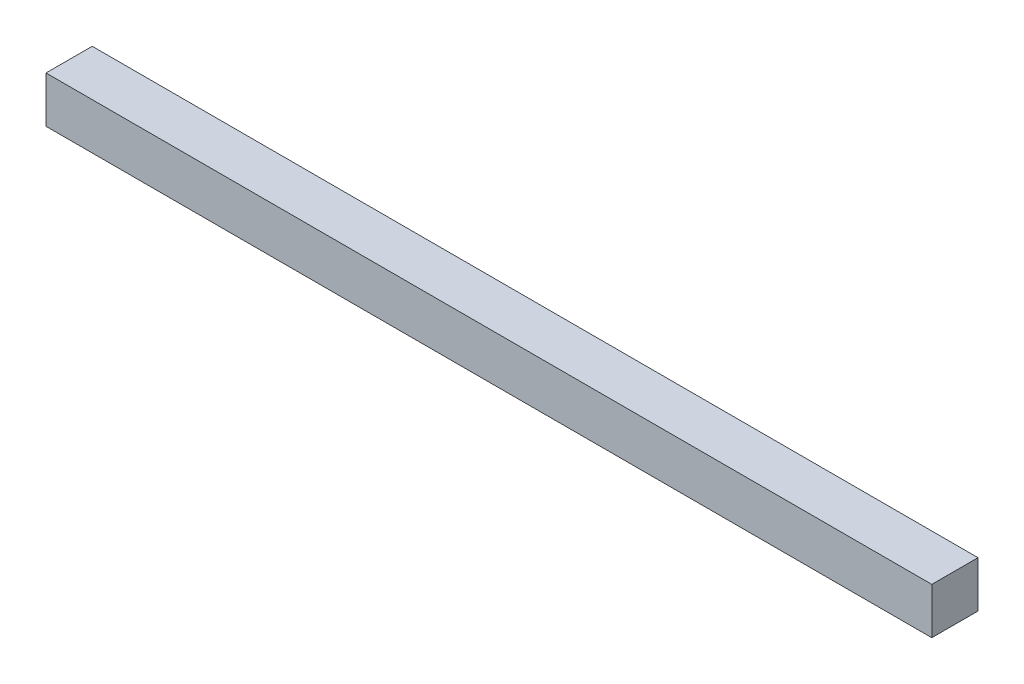
ISO-10303-21;
HEADER;
FILE_DESCRIPTION(('STEP AP214'),'2;1');
FILE_NAME('part.step','',(''),(''),'','','');
FILE_SCHEMA(('AUTOMOTIVE_DESIGN { 1 0 10303 214 1 1 1 1 }'));
ENDSEC;
DATA;
#1=APPLICATION_CONTEXT('core data for automotive mechanical design processes');
#2=APPLICATION_PROTOCOL_DEFINITION('international standard','automotive_design',2000,#1);
#3=PRODUCT_CONTEXT('',#1,'mechanical');
#4=PRODUCT('Part','Part','',(#3));
#5=PRODUCT_RELATED_PRODUCT_CATEGORY('part','',(#4));
#6=PRODUCT_DEFINITION_FORMATION('','',#4);
#7=PRODUCT_DEFINITION_CONTEXT('part definition',#1,'design');
#8=PRODUCT_DEFINITION('design','',#6,#7);
#9=PRODUCT_DEFINITION_SHAPE('','',#8);
#10=(LENGTH_UNIT() NAMED_UNIT(*) SI_UNIT(.MILLI.,.METRE.));
#11=(NAMED_UNIT(*) PLANE_ANGLE_UNIT() SI_UNIT($,.RADIAN.));
#12=(NAMED_UNIT(*) SI_UNIT($,.STERADIAN.) SOLID_ANGLE_UNIT());
#13=UNCERTAINTY_MEASURE_WITH_UNIT(LENGTH_MEASURE(1.E-05),#10,'distance_accuracy_value','');
#14=(GEOMETRIC_REPRESENTATION_CONTEXT(3) GLOBAL_UNCERTAINTY_ASSIGNED_CONTEXT((#13)) GLOBAL_UNIT_ASSIGNED_CONTEXT((#10,
#11,#12)) REPRESENTATION_CONTEXT('',''));
#15=CARTESIAN_POINT('',(0.,0.,0.));
#16=DIRECTION('',(0.,0.,1.));
#17=DIRECTION('',(1.,0.,0.));
#18=AXIS2_PLACEMENT_3D('',#15,#16,#17);
#19=CARTESIAN_POINT('',(5.75,0.3,0.3));
#20=DIRECTION('',(-1.,0.,0.));
#21=DIRECTION('',(0.,0.,1.));
#22=AXIS2_PLACEMENT_3D('',#19,#20,#21);
#23=PLANE('',#22);
#24=DIRECTION('',(0.,0.,-1.));
#25=VECTOR('',#24,1.);
#26=CARTESIAN_POINT('',(5.75,-0.3,0.3));
#27=LINE('',#26,#25);
#28=CARTESIAN_POINT('',(5.75,-0.3,0.3));
#29=VERTEX_POINT('',#28);
#30=CARTESIAN_POINT('',(5.75,-0.3,-0.3));
#31=VERTEX_POINT('',#30);
#32=EDGE_CURVE('E95',#29,#31,#27,.T.);
#33=ORIENTED_EDGE('',*,*,#32,.T.);
#34=DIRECTION('',(0.,-1.,0.));
#35=VECTOR('',#34,1.);
#36=CARTESIAN_POINT('',(5.75,0.3,-0.3));
#37=LINE('',#36,#35);
#38=CARTESIAN_POINT('',(5.75,0.3,-0.3));
#39=VERTEX_POINT('',#38);
#40=EDGE_CURVE('E11',#39,#31,#37,.T.);
#41=ORIENTED_EDGE('',*,*,#40,.F.);
#42=DIRECTION('',(0.,0.,-1.));
#43=VECTOR('',#42,1.);
#44=CARTESIAN_POINT('',(5.75,0.3,0.3));
#45=LINE('',#44,#43);
#46=CARTESIAN_POINT('',(5.75,0.3,0.3));
#47=VERTEX_POINT('',#46);
#48=EDGE_CURVE('E83',#47,#39,#45,.T.);
#49=ORIENTED_EDGE('',*,*,#48,.F.);
#50=DIRECTION('',(0.,-1.,0.));
#51=VECTOR('',#50,1.);
#52=CARTESIAN_POINT('',(5.75,0.3,0.3));
#53=LINE('',#52,#51);
#54=EDGE_CURVE('E91',#47,#29,#53,.T.);
#55=ORIENTED_EDGE('',*,*,#54,.T.);
#56=EDGE_LOOP('',(#33,#41,#49,#55));
#57=FACE_BOUND('',#56,.T.);
#58=ADVANCED_FACE('F32',(#57),#23,.F.);
#59=CARTESIAN_POINT('',(-5.75,0.3,-0.3));
#60=DIRECTION('',(0.,0.,1.));
#61=DIRECTION('',(1.,0.,0.));
#62=AXIS2_PLACEMENT_3D('',#59,#60,#61);
#63=PLANE('',#62);
#64=DIRECTION('',(-1.,0.,0.));
#65=VECTOR('',#64,1.);
#66=CARTESIAN_POINT('',(-5.75,-0.3,-0.3));
#67=LINE('',#66,#65);
#68=CARTESIAN_POINT('',(-5.75,-0.3,-0.3));
#69=VERTEX_POINT('',#68);
#70=EDGE_CURVE('E87',#31,#69,#67,.T.);
#71=ORIENTED_EDGE('',*,*,#70,.T.);
#72=DIRECTION('',(0.,-1.,0.));
#73=VECTOR('',#72,1.);
#74=CARTESIAN_POINT('',(-5.75,0.3,-0.3));
#75=LINE('',#74,#73);
#76=CARTESIAN_POINT('',(-5.75,0.3,-0.3));
#77=VERTEX_POINT('',#76);
#78=EDGE_CURVE('E40',#77,#69,#75,.T.);
#79=ORIENTED_EDGE('',*,*,#78,.F.);
#80=DIRECTION('',(-1.,0.,0.));
#81=VECTOR('',#80,1.);
#82=CARTESIAN_POINT('',(-5.75,0.3,-0.3));
#83=LINE('',#82,#81);
#84=EDGE_CURVE('E78',#39,#77,#83,.T.);
#85=ORIENTED_EDGE('',*,*,#84,.F.);
#86=ORIENTED_EDGE('',*,*,#40,.T.);
#87=EDGE_LOOP('',(#71,#79,#85,#86));
#88=FACE_BOUND('',#87,.T.);
#89=ADVANCED_FACE('F86',(#88),#63,.F.);
#90=CARTESIAN_POINT('',(-5.75,0.3,0.3));
#91=DIRECTION('',(1.,0.,0.));
#92=DIRECTION('',(0.,0.,-1.));
#93=AXIS2_PLACEMENT_3D('',#90,#91,#92);
#94=PLANE('',#93);
#95=DIRECTION('',(0.,0.,1.));
#96=VECTOR('',#95,1.);
#97=CARTESIAN_POINT('',(-5.75,-0.3,0.3));
#98=LINE('',#97,#96);
#99=CARTESIAN_POINT('',(-5.75,-0.3,0.3));
#100=VERTEX_POINT('',#99);
#101=EDGE_CURVE('E65',#69,#100,#98,.T.);
#102=ORIENTED_EDGE('',*,*,#101,.T.);
#103=DIRECTION('',(0.,-1.,0.));
#104=VECTOR('',#103,1.);
#105=CARTESIAN_POINT('',(-5.75,0.3,0.3));
#106=LINE('',#105,#104);
#107=CARTESIAN_POINT('',(-5.75,0.3,0.3));
#108=VERTEX_POINT('',#107);
#109=EDGE_CURVE('E88',#108,#100,#106,.T.);
#110=ORIENTED_EDGE('',*,*,#109,.F.);
#111=DIRECTION('',(0.,0.,1.));
#112=VECTOR('',#111,1.);
#113=CARTESIAN_POINT('',(-5.75,0.3,0.3));
#114=LINE('',#113,#112);
#115=EDGE_CURVE('E81',#77,#108,#114,.T.);
#116=ORIENTED_EDGE('',*,*,#115,.F.);
#117=ORIENTED_EDGE('',*,*,#78,.T.);
#118=EDGE_LOOP('',(#102,#110,#116,#117));
#119=FACE_BOUND('',#118,.T.);
#120=ADVANCED_FACE('F89',(#119),#94,.F.);
#121=CARTESIAN_POINT('',(-5.75,0.3,0.3));
#122=DIRECTION('',(0.,0.,-1.));
#123=DIRECTION('',(-1.,0.,0.));
#124=AXIS2_PLACEMENT_3D('',#121,#122,#123);
#125=PLANE('',#124);
#126=DIRECTION('',(1.,0.,0.));
#127=VECTOR('',#126,1.);
#128=CARTESIAN_POINT('',(-5.75,-0.3,0.3));
#129=LINE('',#128,#127);
#130=EDGE_CURVE('E71',#100,#29,#129,.T.);
#131=ORIENTED_EDGE('',*,*,#130,.T.);
#132=ORIENTED_EDGE('',*,*,#54,.F.);
#133=DIRECTION('',(1.,0.,0.));
#134=VECTOR('',#133,1.);
#135=CARTESIAN_POINT('',(-5.75,0.3,0.3));
#136=LINE('',#135,#134);
#137=EDGE_CURVE('E48',#108,#47,#136,.T.);
#138=ORIENTED_EDGE('',*,*,#137,.F.);
#139=ORIENTED_EDGE('',*,*,#109,.T.);
#140=EDGE_LOOP('',(#131,#132,#138,#139));
#141=FACE_BOUND('',#140,.T.);
#142=ADVANCED_FACE('F102',(#141),#125,.F.);
#143=CARTESIAN_POINT('',(0.,0.3,0.));
#144=DIRECTION('',(0.,-1.,0.));
#145=DIRECTION('',(0.,0.,-1.));
#146=AXIS2_PLACEMENT_3D('',#143,#144,#145);
#147=PLANE('',#146);
#148=ORIENTED_EDGE('',*,*,#48,.T.);
#149=ORIENTED_EDGE('',*,*,#84,.T.);
#150=ORIENTED_EDGE('',*,*,#115,.T.);
#151=ORIENTED_EDGE('',*,*,#137,.T.);
#152=EDGE_LOOP('',(#148,#149,#150,#151));
#153=FACE_BOUND('',#152,.T.);
#154=ADVANCED_FACE('F79',(#153),#147,.F.);
#155=CARTESIAN_POINT('',(0.,-0.3,0.));
#156=DIRECTION('',(0.,-1.,0.));
#157=DIRECTION('',(0.,0.,-1.));
#158=AXIS2_PLACEMENT_3D('',#155,#156,#157);
#159=PLANE('',#158);
#160=ORIENTED_EDGE('',*,*,#32,.F.);
#161=ORIENTED_EDGE('',*,*,#130,.F.);
#162=ORIENTED_EDGE('',*,*,#101,.F.);
#163=ORIENTED_EDGE('',*,*,#70,.F.);
#164=EDGE_LOOP('',(#160,#161,#162,#163));
#165=FACE_BOUND('',#164,.T.);
#166=ADVANCED_FACE('F105',(#165),#159,.T.);
#167=CLOSED_SHELL('',(#58,#89,#120,#142,#154,#166));
#168=MANIFOLD_SOLID_BREP('B2',#167);
#169=ADVANCED_BREP_SHAPE_REPRESENTATION('',(#18,#168),#14);
#170=SHAPE_DEFINITION_REPRESENTATION(#9,#169);
ENDSEC;
END-ISO-10303-21;
